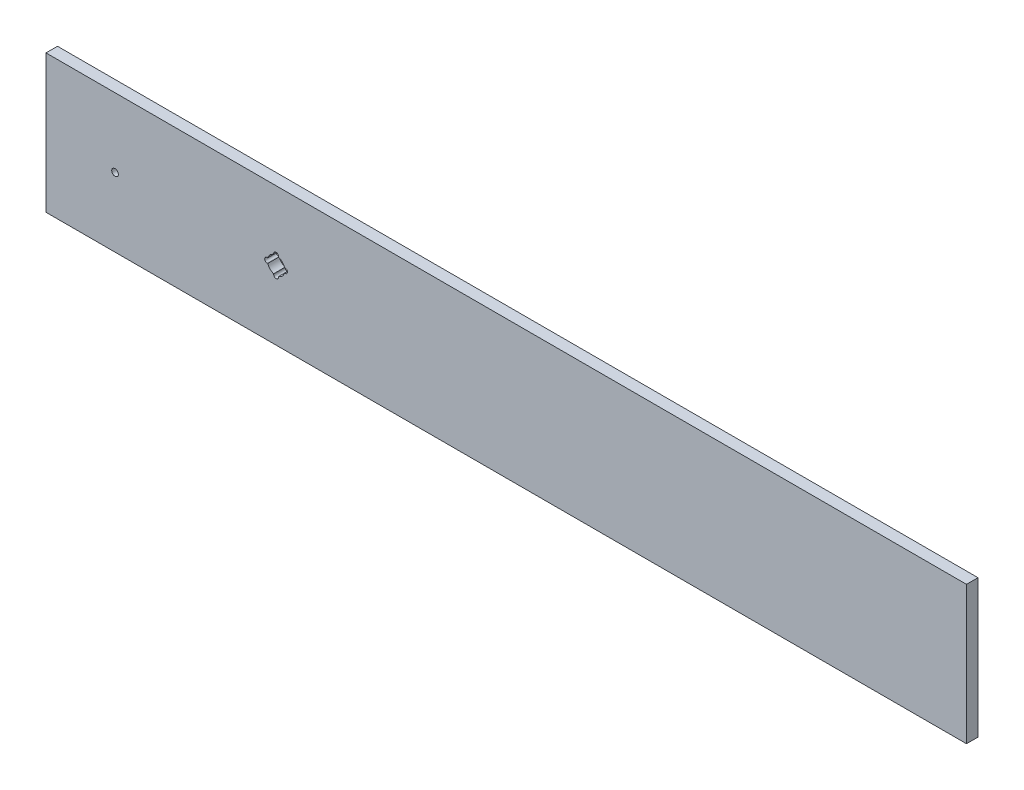
ISO-10303-21;
HEADER;
FILE_DESCRIPTION(('STEP AP214'),'2;1');
FILE_NAME('part.step','',(''),(''),'','','');
FILE_SCHEMA(('AUTOMOTIVE_DESIGN { 1 0 10303 214 1 1 1 1 }'));
ENDSEC;
DATA;
#1=APPLICATION_CONTEXT('core data for automotive mechanical design processes');
#2=APPLICATION_PROTOCOL_DEFINITION('international standard','automotive_design',2000,#1);
#3=PRODUCT_CONTEXT('',#1,'mechanical');
#4=PRODUCT('Part','Part','',(#3));
#5=PRODUCT_RELATED_PRODUCT_CATEGORY('part','',(#4));
#6=PRODUCT_DEFINITION_FORMATION('','',#4);
#7=PRODUCT_DEFINITION_CONTEXT('part definition',#1,'design');
#8=PRODUCT_DEFINITION('design','',#6,#7);
#9=PRODUCT_DEFINITION_SHAPE('','',#8);
#10=(LENGTH_UNIT() NAMED_UNIT(*) SI_UNIT(.MILLI.,.METRE.));
#11=(NAMED_UNIT(*) PLANE_ANGLE_UNIT() SI_UNIT($,.RADIAN.));
#12=(NAMED_UNIT(*) SI_UNIT($,.STERADIAN.) SOLID_ANGLE_UNIT());
#13=UNCERTAINTY_MEASURE_WITH_UNIT(LENGTH_MEASURE(1.E-05),#10,'distance_accuracy_value','');
#14=(GEOMETRIC_REPRESENTATION_CONTEXT(3) GLOBAL_UNCERTAINTY_ASSIGNED_CONTEXT((#13)) GLOBAL_UNIT_ASSIGNED_CONTEXT((#10,
#11,#12)) REPRESENTATION_CONTEXT('',''));
#15=CARTESIAN_POINT('',(0.,0.,0.));
#16=DIRECTION('',(0.,0.,1.));
#17=DIRECTION('',(1.,0.,0.));
#18=AXIS2_PLACEMENT_3D('',#15,#16,#17);
#19=CARTESIAN_POINT('',(0.,76.2,6.35));
#20=DIRECTION('',(0.,0.,-1.));
#21=DIRECTION('',(-1.,0.,0.));
#22=AXIS2_PLACEMENT_3D('',#19,#20,#21);
#23=PLANE('',#22);
#24=CARTESIAN_POINT('',(38.1,38.1,6.35));
#25=DIRECTION('',(0.,0.,1.));
#26=DIRECTION('',(1.,0.,0.));
#27=AXIS2_PLACEMENT_3D('',#24,#25,#26);
#28=CIRCLE('',#27,1.84149999999999);
#29=CARTESIAN_POINT('',(39.9415,38.1,6.35));
#30=VERTEX_POINT('',#29);
#31=EDGE_CURVE('E506',#30,#30,#28,.T.);
#32=ORIENTED_EDGE('',*,*,#31,.F.);
#33=EDGE_LOOP('',(#32));
#34=FACE_BOUND('',#33,.T.);
#35=DIRECTION('',(0.,-1.,0.));
#36=VECTOR('',#35,1.);
#37=CARTESIAN_POINT('',(0.,0.,6.35));
#38=LINE('',#37,#36);
#39=CARTESIAN_POINT('',(0.,76.2,6.35));
#40=VERTEX_POINT('',#39);
#41=CARTESIAN_POINT('',(0.,0.,6.35));
#42=VERTEX_POINT('',#41);
#43=EDGE_CURVE('E293',#40,#42,#38,.T.);
#44=ORIENTED_EDGE('',*,*,#43,.T.);
#45=DIRECTION('',(1.,0.,0.));
#46=VECTOR('',#45,1.);
#47=CARTESIAN_POINT('',(0.,0.,6.35));
#48=LINE('',#47,#46);
#49=CARTESIAN_POINT('',(508.,0.,6.35));
#50=VERTEX_POINT('',#49);
#51=EDGE_CURVE('E296',#42,#50,#48,.T.);
#52=ORIENTED_EDGE('',*,*,#51,.T.);
#53=DIRECTION('',(0.,1.,0.));
#54=VECTOR('',#53,1.);
#55=CARTESIAN_POINT('',(508.,0.,6.35));
#56=LINE('',#55,#54);
#57=CARTESIAN_POINT('',(508.,76.2,6.35));
#58=VERTEX_POINT('',#57);
#59=EDGE_CURVE('E299',#50,#58,#56,.T.);
#60=ORIENTED_EDGE('',*,*,#59,.T.);
#61=DIRECTION('',(-1.,0.,0.));
#62=VECTOR('',#61,1.);
#63=CARTESIAN_POINT('',(0.,76.2,6.35));
#64=LINE('',#63,#62);
#65=EDGE_CURVE('E301',#58,#40,#64,.T.);
#66=ORIENTED_EDGE('',*,*,#65,.T.);
#67=EDGE_LOOP('',(#44,#52,#60,#66));
#68=FACE_BOUND('',#67,.T.);
#69=DIRECTION('',(1.,0.,0.));
#70=VECTOR('',#69,1.);
#71=CARTESIAN_POINT('',(254.,39.4462,6.35));
#72=LINE('',#71,#70);
#73=CARTESIAN_POINT('',(131.60798284719,39.4462,6.35));
#74=VERTEX_POINT('',#73);
#75=CARTESIAN_POINT('',(131.953,39.4462,6.35));
#76=VERTEX_POINT('',#75);
#77=EDGE_CURVE('E491',#74,#76,#72,.T.);
#78=ORIENTED_EDGE('',*,*,#77,.T.);
#79=CARTESIAN_POINT('',(131.953,38.1,6.35));
#80=DIRECTION('',(0.,0.,1.));
#81=DIRECTION('',(1.,0.,0.));
#82=AXIS2_PLACEMENT_3D('',#79,#80,#81);
#83=CIRCLE('',#82,1.3462);
#84=CARTESIAN_POINT('',(131.953,36.7538,6.35));
#85=VERTEX_POINT('',#84);
#86=EDGE_CURVE('E493',#85,#76,#83,.T.);
#87=ORIENTED_EDGE('',*,*,#86,.F.);
#88=DIRECTION('',(1.,0.,0.));
#89=VECTOR('',#88,1.);
#90=CARTESIAN_POINT('',(254.,36.7538,6.35));
#91=LINE('',#90,#89);
#92=CARTESIAN_POINT('',(131.60798284719,36.7538,6.35));
#93=VERTEX_POINT('',#92);
#94=EDGE_CURVE('E496',#93,#85,#91,.T.);
#95=ORIENTED_EDGE('',*,*,#94,.F.);
#96=CARTESIAN_POINT('',(127.,38.1,6.35));
#97=DIRECTION('',(0.,0.,1.));
#98=DIRECTION('',(1.,0.,0.));
#99=AXIS2_PLACEMENT_3D('',#96,#97,#98);
#100=CIRCLE('',#99,4.80059999999999);
#101=CARTESIAN_POINT('',(128.3462,33.4920171528097,6.35));
#102=VERTEX_POINT('',#101);
#103=EDGE_CURVE('E431',#93,#102,#100,.F.);
#104=ORIENTED_EDGE('',*,*,#103,.T.);
#105=DIRECTION('',(0.,-1.,0.));
#106=VECTOR('',#105,1.);
#107=CARTESIAN_POINT('',(128.3462,43.053,6.35));
#108=LINE('',#107,#106);
#109=CARTESIAN_POINT('',(128.3462,33.147,6.35));
#110=VERTEX_POINT('',#109);
#111=EDGE_CURVE('E236',#102,#110,#108,.T.);
#112=ORIENTED_EDGE('',*,*,#111,.T.);
#113=CARTESIAN_POINT('',(127.,33.147,6.35));
#114=DIRECTION('',(0.,0.,1.));
#115=DIRECTION('',(1.,0.,0.));
#116=AXIS2_PLACEMENT_3D('',#113,#114,#115);
#117=CIRCLE('',#116,1.34619999999998);
#118=CARTESIAN_POINT('',(125.6538,33.147,6.35));
#119=VERTEX_POINT('',#118);
#120=EDGE_CURVE('E278',#119,#110,#117,.T.);
#121=ORIENTED_EDGE('',*,*,#120,.F.);
#122=DIRECTION('',(0.,-1.,0.));
#123=VECTOR('',#122,1.);
#124=CARTESIAN_POINT('',(125.6538,43.053,6.35));
#125=LINE('',#124,#123);
#126=CARTESIAN_POINT('',(125.6538,33.4920171528097,6.35));
#127=VERTEX_POINT('',#126);
#128=EDGE_CURVE('E281',#127,#119,#125,.T.);
#129=ORIENTED_EDGE('',*,*,#128,.F.);
#130=CARTESIAN_POINT('',(127.,38.1,6.35));
#131=DIRECTION('',(0.,0.,1.));
#132=DIRECTION('',(1.,0.,0.));
#133=AXIS2_PLACEMENT_3D('',#130,#131,#132);
#134=CIRCLE('',#133,4.8006);
#135=CARTESIAN_POINT('',(122.39201715281,36.7538,6.35));
#136=VERTEX_POINT('',#135);
#137=EDGE_CURVE('E439',#136,#127,#134,.T.);
#138=ORIENTED_EDGE('',*,*,#137,.F.);
#139=DIRECTION('',(1.,0.,0.));
#140=VECTOR('',#139,1.);
#141=CARTESIAN_POINT('',(254.,36.7538,6.35));
#142=LINE('',#141,#140);
#143=CARTESIAN_POINT('',(122.047,36.7538,6.35));
#144=VERTEX_POINT('',#143);
#145=EDGE_CURVE('E461',#144,#136,#142,.T.);
#146=ORIENTED_EDGE('',*,*,#145,.F.);
#147=CARTESIAN_POINT('',(122.047,38.1,6.35));
#148=DIRECTION('',(0.,0.,1.));
#149=DIRECTION('',(1.,0.,0.));
#150=AXIS2_PLACEMENT_3D('',#147,#148,#149);
#151=CIRCLE('',#150,1.3462);
#152=CARTESIAN_POINT('',(122.047,39.4462,6.35));
#153=VERTEX_POINT('',#152);
#154=EDGE_CURVE('E453',#153,#144,#151,.T.);
#155=ORIENTED_EDGE('',*,*,#154,.F.);
#156=DIRECTION('',(1.,0.,0.));
#157=VECTOR('',#156,1.);
#158=CARTESIAN_POINT('',(254.,39.4462,6.35));
#159=LINE('',#158,#157);
#160=CARTESIAN_POINT('',(122.39201715281,39.4462,6.35));
#161=VERTEX_POINT('',#160);
#162=EDGE_CURVE('E451',#153,#161,#159,.T.);
#163=ORIENTED_EDGE('',*,*,#162,.T.);
#164=CARTESIAN_POINT('',(127.,38.1,6.35));
#165=DIRECTION('',(0.,0.,1.));
#166=DIRECTION('',(1.,0.,0.));
#167=AXIS2_PLACEMENT_3D('',#164,#165,#166);
#168=CIRCLE('',#167,4.8006);
#169=CARTESIAN_POINT('',(125.6538,42.7079828471903,6.35));
#170=VERTEX_POINT('',#169);
#171=EDGE_CURVE('E292',#161,#170,#168,.F.);
#172=ORIENTED_EDGE('',*,*,#171,.T.);
#173=CARTESIAN_POINT('',(125.6538,43.053,6.35));
#174=VERTEX_POINT('',#173);
#175=EDGE_CURVE('E262',#174,#170,#125,.T.);
#176=ORIENTED_EDGE('',*,*,#175,.F.);
#177=CARTESIAN_POINT('',(127.,43.053,6.35));
#178=DIRECTION('',(0.,0.,1.));
#179=DIRECTION('',(1.,0.,0.));
#180=AXIS2_PLACEMENT_3D('',#177,#178,#179);
#181=CIRCLE('',#180,1.34619999999998);
#182=CARTESIAN_POINT('',(128.3462,43.053,6.35));
#183=VERTEX_POINT('',#182);
#184=EDGE_CURVE('E258',#183,#174,#181,.T.);
#185=ORIENTED_EDGE('',*,*,#184,.F.);
#186=CARTESIAN_POINT('',(128.3462,42.7079828471903,6.35));
#187=VERTEX_POINT('',#186);
#188=EDGE_CURVE('E275',#183,#187,#108,.T.);
#189=ORIENTED_EDGE('',*,*,#188,.T.);
#190=CARTESIAN_POINT('',(127.,38.1,6.35));
#191=DIRECTION('',(0.,0.,1.));
#192=DIRECTION('',(1.,0.,0.));
#193=AXIS2_PLACEMENT_3D('',#190,#191,#192);
#194=CIRCLE('',#193,4.80060000000002);
#195=EDGE_CURVE('E108',#74,#187,#194,.T.);
#196=ORIENTED_EDGE('',*,*,#195,.F.);
#197=EDGE_LOOP('',(#78,#87,#95,#104,#112,#121,#129,#138,#146,#155,#163,#172,#176,#185,#189,#196));
#198=FACE_BOUND('',#197,.T.);
#199=ADVANCED_FACE('F93',(#34,#68,#198),#23,.F.);
#200=CARTESIAN_POINT('',(0.,76.2,0.));
#201=DIRECTION('',(0.,0.,-1.));
#202=DIRECTION('',(-1.,0.,0.));
#203=AXIS2_PLACEMENT_3D('',#200,#201,#202);
#204=PLANE('',#203);
#205=CARTESIAN_POINT('',(38.1,38.1,0.));
#206=DIRECTION('',(0.,0.,1.));
#207=DIRECTION('',(1.,0.,0.));
#208=AXIS2_PLACEMENT_3D('',#205,#206,#207);
#209=CIRCLE('',#208,1.84149999999999);
#210=CARTESIAN_POINT('',(39.9415,38.1,0.));
#211=VERTEX_POINT('',#210);
#212=EDGE_CURVE('E509',#211,#211,#209,.T.);
#213=ORIENTED_EDGE('',*,*,#212,.T.);
#214=EDGE_LOOP('',(#213));
#215=FACE_BOUND('',#214,.T.);
#216=DIRECTION('',(0.,-1.,0.));
#217=VECTOR('',#216,1.);
#218=CARTESIAN_POINT('',(0.,0.,0.));
#219=LINE('',#218,#217);
#220=CARTESIAN_POINT('',(0.,76.2,0.));
#221=VERTEX_POINT('',#220);
#222=CARTESIAN_POINT('',(0.,0.,0.));
#223=VERTEX_POINT('',#222);
#224=EDGE_CURVE('E304',#221,#223,#219,.T.);
#225=ORIENTED_EDGE('',*,*,#224,.F.);
#226=DIRECTION('',(-1.,0.,0.));
#227=VECTOR('',#226,1.);
#228=CARTESIAN_POINT('',(0.,76.2,0.));
#229=LINE('',#228,#227);
#230=CARTESIAN_POINT('',(508.,76.2,0.));
#231=VERTEX_POINT('',#230);
#232=EDGE_CURVE('E297',#231,#221,#229,.T.);
#233=ORIENTED_EDGE('',*,*,#232,.F.);
#234=DIRECTION('',(0.,1.,0.));
#235=VECTOR('',#234,1.);
#236=CARTESIAN_POINT('',(508.,0.,0.));
#237=LINE('',#236,#235);
#238=CARTESIAN_POINT('',(508.,0.,0.));
#239=VERTEX_POINT('',#238);
#240=EDGE_CURVE('E310',#239,#231,#237,.T.);
#241=ORIENTED_EDGE('',*,*,#240,.F.);
#242=DIRECTION('',(1.,0.,0.));
#243=VECTOR('',#242,1.);
#244=CARTESIAN_POINT('',(0.,0.,0.));
#245=LINE('',#244,#243);
#246=EDGE_CURVE('E307',#223,#239,#245,.T.);
#247=ORIENTED_EDGE('',*,*,#246,.F.);
#248=EDGE_LOOP('',(#225,#233,#241,#247));
#249=FACE_BOUND('',#248,.T.);
#250=CARTESIAN_POINT('',(131.953,38.1,0.));
#251=DIRECTION('',(0.,0.,1.));
#252=DIRECTION('',(1.,0.,0.));
#253=AXIS2_PLACEMENT_3D('',#250,#251,#252);
#254=CIRCLE('',#253,1.3462);
#255=CARTESIAN_POINT('',(131.953,36.7538,0.));
#256=VERTEX_POINT('',#255);
#257=CARTESIAN_POINT('',(131.953,39.4462,0.));
#258=VERTEX_POINT('',#257);
#259=EDGE_CURVE('E503',#256,#258,#254,.T.);
#260=ORIENTED_EDGE('',*,*,#259,.T.);
#261=DIRECTION('',(1.,0.,0.));
#262=VECTOR('',#261,1.);
#263=CARTESIAN_POINT('',(254.,39.4462,0.));
#264=LINE('',#263,#262);
#265=CARTESIAN_POINT('',(131.60798284719,39.4462,0.));
#266=VERTEX_POINT('',#265);
#267=EDGE_CURVE('E501',#266,#258,#264,.T.);
#268=ORIENTED_EDGE('',*,*,#267,.F.);
#269=CARTESIAN_POINT('',(127.,38.1,0.));
#270=DIRECTION('',(0.,0.,1.));
#271=DIRECTION('',(1.,0.,0.));
#272=AXIS2_PLACEMENT_3D('',#269,#270,#271);
#273=CIRCLE('',#272,4.80060000000002);
#274=CARTESIAN_POINT('',(128.3462,42.7079828471903,0.));
#275=VERTEX_POINT('',#274);
#276=EDGE_CURVE('E241',#266,#275,#273,.T.);
#277=ORIENTED_EDGE('',*,*,#276,.T.);
#278=DIRECTION('',(0.,-1.,0.));
#279=VECTOR('',#278,1.);
#280=CARTESIAN_POINT('',(128.3462,43.053,0.));
#281=LINE('',#280,#279);
#282=CARTESIAN_POINT('',(128.3462,43.053,0.));
#283=VERTEX_POINT('',#282);
#284=EDGE_CURVE('E257',#283,#275,#281,.T.);
#285=ORIENTED_EDGE('',*,*,#284,.F.);
#286=CARTESIAN_POINT('',(127.,43.053,0.));
#287=DIRECTION('',(0.,0.,1.));
#288=DIRECTION('',(1.,0.,0.));
#289=AXIS2_PLACEMENT_3D('',#286,#287,#288);
#290=CIRCLE('',#289,1.34619999999998);
#291=CARTESIAN_POINT('',(125.6538,43.053,0.));
#292=VERTEX_POINT('',#291);
#293=EDGE_CURVE('E116',#283,#292,#290,.T.);
#294=ORIENTED_EDGE('',*,*,#293,.T.);
#295=DIRECTION('',(0.,-1.,0.));
#296=VECTOR('',#295,1.);
#297=CARTESIAN_POINT('',(125.6538,43.053,0.));
#298=LINE('',#297,#296);
#299=CARTESIAN_POINT('',(125.6538,42.7079828471903,0.));
#300=VERTEX_POINT('',#299);
#301=EDGE_CURVE('E270',#292,#300,#298,.T.);
#302=ORIENTED_EDGE('',*,*,#301,.T.);
#303=CARTESIAN_POINT('',(127.,38.1,0.));
#304=DIRECTION('',(0.,0.,1.));
#305=DIRECTION('',(1.,0.,0.));
#306=AXIS2_PLACEMENT_3D('',#303,#304,#305);
#307=CIRCLE('',#306,4.8006);
#308=CARTESIAN_POINT('',(122.39201715281,39.4462,0.));
#309=VERTEX_POINT('',#308);
#310=EDGE_CURVE('E436',#309,#300,#307,.F.);
#311=ORIENTED_EDGE('',*,*,#310,.F.);
#312=DIRECTION('',(1.,0.,0.));
#313=VECTOR('',#312,1.);
#314=CARTESIAN_POINT('',(254.,39.4462,0.));
#315=LINE('',#314,#313);
#316=CARTESIAN_POINT('',(122.047,39.4462,0.));
#317=VERTEX_POINT('',#316);
#318=EDGE_CURVE('E438',#317,#309,#315,.T.);
#319=ORIENTED_EDGE('',*,*,#318,.F.);
#320=CARTESIAN_POINT('',(122.047,38.1,0.));
#321=DIRECTION('',(0.,0.,1.));
#322=DIRECTION('',(1.,0.,0.));
#323=AXIS2_PLACEMENT_3D('',#320,#321,#322);
#324=CIRCLE('',#323,1.3462);
#325=CARTESIAN_POINT('',(122.047,36.7538,0.));
#326=VERTEX_POINT('',#325);
#327=EDGE_CURVE('E476',#317,#326,#324,.T.);
#328=ORIENTED_EDGE('',*,*,#327,.T.);
#329=DIRECTION('',(1.,0.,0.));
#330=VECTOR('',#329,1.);
#331=CARTESIAN_POINT('',(254.,36.7538,0.));
#332=LINE('',#331,#330);
#333=CARTESIAN_POINT('',(122.39201715281,36.7538,0.));
#334=VERTEX_POINT('',#333);
#335=EDGE_CURVE('E473',#326,#334,#332,.T.);
#336=ORIENTED_EDGE('',*,*,#335,.T.);
#337=CARTESIAN_POINT('',(127.,38.1,0.));
#338=DIRECTION('',(0.,0.,1.));
#339=DIRECTION('',(1.,0.,0.));
#340=AXIS2_PLACEMENT_3D('',#337,#338,#339);
#341=CIRCLE('',#340,4.8006);
#342=CARTESIAN_POINT('',(125.6538,33.4920171528097,0.));
#343=VERTEX_POINT('',#342);
#344=EDGE_CURVE('E456',#334,#343,#341,.T.);
#345=ORIENTED_EDGE('',*,*,#344,.T.);
#346=CARTESIAN_POINT('',(125.6538,33.147,0.));
#347=VERTEX_POINT('',#346);
#348=EDGE_CURVE('E269',#343,#347,#298,.T.);
#349=ORIENTED_EDGE('',*,*,#348,.T.);
#350=CARTESIAN_POINT('',(127.,33.147,0.));
#351=DIRECTION('',(0.,0.,1.));
#352=DIRECTION('',(1.,0.,0.));
#353=AXIS2_PLACEMENT_3D('',#350,#351,#352);
#354=CIRCLE('',#353,1.34619999999998);
#355=CARTESIAN_POINT('',(128.3462,33.147,0.));
#356=VERTEX_POINT('',#355);
#357=EDGE_CURVE('E256',#347,#356,#354,.T.);
#358=ORIENTED_EDGE('',*,*,#357,.T.);
#359=CARTESIAN_POINT('',(128.3462,33.4920171528097,0.));
#360=VERTEX_POINT('',#359);
#361=EDGE_CURVE('E233',#360,#356,#281,.T.);
#362=ORIENTED_EDGE('',*,*,#361,.F.);
#363=CARTESIAN_POINT('',(127.,38.1,0.));
#364=DIRECTION('',(0.,0.,1.));
#365=DIRECTION('',(1.,0.,0.));
#366=AXIS2_PLACEMENT_3D('',#363,#364,#365);
#367=CIRCLE('',#366,4.80059999999999);
#368=CARTESIAN_POINT('',(131.60798284719,36.7538,0.));
#369=VERTEX_POINT('',#368);
#370=EDGE_CURVE('E244',#369,#360,#367,.F.);
#371=ORIENTED_EDGE('',*,*,#370,.F.);
#372=DIRECTION('',(1.,0.,0.));
#373=VECTOR('',#372,1.);
#374=CARTESIAN_POINT('',(254.,36.7538,0.));
#375=LINE('',#374,#373);
#376=EDGE_CURVE('E249',#369,#256,#375,.T.);
#377=ORIENTED_EDGE('',*,*,#376,.T.);
#378=EDGE_LOOP('',(#260,#268,#277,#285,#294,#302,#311,#319,#328,#336,#345,#349,#358,#362,#371,#377));
#379=FACE_BOUND('',#378,.T.);
#380=ADVANCED_FACE('F253',(#215,#249,#379),#204,.T.);
#381=CARTESIAN_POINT('',(0.,0.,6.35));
#382=DIRECTION('',(1.,0.,0.));
#383=DIRECTION('',(0.,0.,-1.));
#384=AXIS2_PLACEMENT_3D('',#381,#382,#383);
#385=PLANE('',#384);
#386=ORIENTED_EDGE('',*,*,#224,.T.);
#387=DIRECTION('',(0.,0.,-1.));
#388=VECTOR('',#387,1.);
#389=CARTESIAN_POINT('',(0.,0.,6.35));
#390=LINE('',#389,#388);
#391=EDGE_CURVE('E12',#42,#223,#390,.T.);
#392=ORIENTED_EDGE('',*,*,#391,.F.);
#393=ORIENTED_EDGE('',*,*,#43,.F.);
#394=DIRECTION('',(0.,0.,-1.));
#395=VECTOR('',#394,1.);
#396=CARTESIAN_POINT('',(0.,76.2,6.35));
#397=LINE('',#396,#395);
#398=EDGE_CURVE('E303',#40,#221,#397,.T.);
#399=ORIENTED_EDGE('',*,*,#398,.T.);
#400=EDGE_LOOP('',(#386,#392,#393,#399));
#401=FACE_BOUND('',#400,.T.);
#402=ADVANCED_FACE('F95',(#401),#385,.F.);
#403=CARTESIAN_POINT('',(0.,0.,6.35));
#404=DIRECTION('',(0.,1.,0.));
#405=DIRECTION('',(0.,0.,1.));
#406=AXIS2_PLACEMENT_3D('',#403,#404,#405);
#407=PLANE('',#406);
#408=ORIENTED_EDGE('',*,*,#246,.T.);
#409=DIRECTION('',(0.,0.,-1.));
#410=VECTOR('',#409,1.);
#411=CARTESIAN_POINT('',(508.,0.,6.35));
#412=LINE('',#411,#410);
#413=EDGE_CURVE('E101',#50,#239,#412,.T.);
#414=ORIENTED_EDGE('',*,*,#413,.F.);
#415=ORIENTED_EDGE('',*,*,#51,.F.);
#416=ORIENTED_EDGE('',*,*,#391,.T.);
#417=EDGE_LOOP('',(#408,#414,#415,#416));
#418=FACE_BOUND('',#417,.T.);
#419=ADVANCED_FACE('F337',(#418),#407,.F.);
#420=CARTESIAN_POINT('',(508.,0.,6.35));
#421=DIRECTION('',(-1.,0.,0.));
#422=DIRECTION('',(0.,0.,1.));
#423=AXIS2_PLACEMENT_3D('',#420,#421,#422);
#424=PLANE('',#423);
#425=ORIENTED_EDGE('',*,*,#240,.T.);
#426=DIRECTION('',(0.,0.,-1.));
#427=VECTOR('',#426,1.);
#428=CARTESIAN_POINT('',(508.,76.2,6.35));
#429=LINE('',#428,#427);
#430=EDGE_CURVE('E315',#58,#231,#429,.T.);
#431=ORIENTED_EDGE('',*,*,#430,.F.);
#432=ORIENTED_EDGE('',*,*,#59,.F.);
#433=ORIENTED_EDGE('',*,*,#413,.T.);
#434=EDGE_LOOP('',(#425,#431,#432,#433));
#435=FACE_BOUND('',#434,.T.);
#436=ADVANCED_FACE('F322',(#435),#424,.F.);
#437=CARTESIAN_POINT('',(0.,76.2,6.35));
#438=DIRECTION('',(0.,-1.,0.));
#439=DIRECTION('',(0.,0.,-1.));
#440=AXIS2_PLACEMENT_3D('',#437,#438,#439);
#441=PLANE('',#440);
#442=ORIENTED_EDGE('',*,*,#232,.T.);
#443=ORIENTED_EDGE('',*,*,#398,.F.);
#444=ORIENTED_EDGE('',*,*,#65,.F.);
#445=ORIENTED_EDGE('',*,*,#430,.T.);
#446=EDGE_LOOP('',(#442,#443,#444,#445));
#447=FACE_BOUND('',#446,.T.);
#448=ADVANCED_FACE('F330',(#447),#441,.F.);
#449=CARTESIAN_POINT('',(127.,38.1,0.));
#450=DIRECTION('',(0.,0.,1.));
#451=DIRECTION('',(1.,0.,0.));
#452=AXIS2_PLACEMENT_3D('',#449,#450,#451);
#453=CYLINDRICAL_SURFACE('',#452,4.80060000000002);
#454=ORIENTED_EDGE('',*,*,#195,.T.);
#455=DIRECTION('',(0.,0.,1.));
#456=VECTOR('',#455,1.);
#457=CARTESIAN_POINT('',(128.3462,42.7079828471903,0.));
#458=LINE('',#457,#456);
#459=EDGE_CURVE('E308',#275,#187,#458,.T.);
#460=ORIENTED_EDGE('',*,*,#459,.F.);
#461=ORIENTED_EDGE('',*,*,#276,.F.);
#462=DIRECTION('',(0.,0.,1.));
#463=VECTOR('',#462,1.);
#464=CARTESIAN_POINT('',(131.60798284719,39.4462,0.));
#465=LINE('',#464,#463);
#466=EDGE_CURVE('E487',#266,#74,#465,.T.);
#467=ORIENTED_EDGE('',*,*,#466,.T.);
#468=EDGE_LOOP('',(#454,#460,#461,#467));
#469=FACE_BOUND('',#468,.T.);
#470=ADVANCED_FACE('F358',(#469),#453,.F.);
#471=CARTESIAN_POINT('',(254.,39.4462,0.));
#472=DIRECTION('',(0.,-1.,0.));
#473=DIRECTION('',(0.,0.,-1.));
#474=AXIS2_PLACEMENT_3D('',#471,#472,#473);
#475=PLANE('',#474);
#476=ORIENTED_EDGE('',*,*,#77,.F.);
#477=ORIENTED_EDGE('',*,*,#466,.F.);
#478=ORIENTED_EDGE('',*,*,#267,.T.);
#479=DIRECTION('',(0.,0.,1.));
#480=VECTOR('',#479,1.);
#481=CARTESIAN_POINT('',(131.953,39.4462,0.));
#482=LINE('',#481,#480);
#483=EDGE_CURVE('E485',#258,#76,#482,.T.);
#484=ORIENTED_EDGE('',*,*,#483,.T.);
#485=EDGE_LOOP('',(#476,#477,#478,#484));
#486=FACE_BOUND('',#485,.T.);
#487=ADVANCED_FACE('F362',(#486),#475,.T.);
#488=CARTESIAN_POINT('',(131.953,38.1,0.));
#489=DIRECTION('',(0.,0.,1.));
#490=DIRECTION('',(1.,0.,0.));
#491=AXIS2_PLACEMENT_3D('',#488,#489,#490);
#492=CYLINDRICAL_SURFACE('',#491,1.3462);
#493=ORIENTED_EDGE('',*,*,#86,.T.);
#494=ORIENTED_EDGE('',*,*,#483,.F.);
#495=ORIENTED_EDGE('',*,*,#259,.F.);
#496=DIRECTION('',(0.,0.,1.));
#497=VECTOR('',#496,1.);
#498=CARTESIAN_POINT('',(131.953,36.7538,0.));
#499=LINE('',#498,#497);
#500=EDGE_CURVE('E483',#256,#85,#499,.T.);
#501=ORIENTED_EDGE('',*,*,#500,.T.);
#502=EDGE_LOOP('',(#493,#494,#495,#501));
#503=FACE_BOUND('',#502,.T.);
#504=ADVANCED_FACE('F367',(#503),#492,.F.);
#505=CARTESIAN_POINT('',(254.,36.7538,0.));
#506=DIRECTION('',(0.,-1.,0.));
#507=DIRECTION('',(0.,0.,-1.));
#508=AXIS2_PLACEMENT_3D('',#505,#506,#507);
#509=PLANE('',#508);
#510=ORIENTED_EDGE('',*,*,#94,.T.);
#511=ORIENTED_EDGE('',*,*,#500,.F.);
#512=ORIENTED_EDGE('',*,*,#376,.F.);
#513=DIRECTION('',(0.,0.,1.));
#514=VECTOR('',#513,1.);
#515=CARTESIAN_POINT('',(131.60798284719,36.7538,0.));
#516=LINE('',#515,#514);
#517=EDGE_CURVE('E240',#369,#93,#516,.T.);
#518=ORIENTED_EDGE('',*,*,#517,.T.);
#519=EDGE_LOOP('',(#510,#511,#512,#518));
#520=FACE_BOUND('',#519,.T.);
#521=ADVANCED_FACE('F375',(#520),#509,.F.);
#522=CARTESIAN_POINT('',(127.,38.1,0.));
#523=DIRECTION('',(0.,0.,1.));
#524=DIRECTION('',(1.,0.,0.));
#525=AXIS2_PLACEMENT_3D('',#522,#523,#524);
#526=CYLINDRICAL_SURFACE('',#525,4.80059999999999);
#527=ORIENTED_EDGE('',*,*,#103,.F.);
#528=ORIENTED_EDGE('',*,*,#517,.F.);
#529=ORIENTED_EDGE('',*,*,#370,.T.);
#530=DIRECTION('',(0.,0.,1.));
#531=VECTOR('',#530,1.);
#532=CARTESIAN_POINT('',(128.3462,33.4920171528097,0.));
#533=LINE('',#532,#531);
#534=EDGE_CURVE('E229',#360,#102,#533,.T.);
#535=ORIENTED_EDGE('',*,*,#534,.T.);
#536=EDGE_LOOP('',(#527,#528,#529,#535));
#537=FACE_BOUND('',#536,.T.);
#538=ADVANCED_FACE('F245',(#537),#526,.F.);
#539=CARTESIAN_POINT('',(127.,38.1,0.));
#540=DIRECTION('',(0.,0.,1.));
#541=DIRECTION('',(1.,0.,0.));
#542=AXIS2_PLACEMENT_3D('',#539,#540,#541);
#543=CYLINDRICAL_SURFACE('',#542,4.8006);
#544=ORIENTED_EDGE('',*,*,#137,.T.);
#545=DIRECTION('',(0.,0.,1.));
#546=VECTOR('',#545,1.);
#547=CARTESIAN_POINT('',(125.6538,33.4920171528097,0.));
#548=LINE('',#547,#546);
#549=EDGE_CURVE('E432',#343,#127,#548,.T.);
#550=ORIENTED_EDGE('',*,*,#549,.F.);
#551=ORIENTED_EDGE('',*,*,#344,.F.);
#552=DIRECTION('',(0.,0.,1.));
#553=VECTOR('',#552,1.);
#554=CARTESIAN_POINT('',(122.39201715281,36.7538,0.));
#555=LINE('',#554,#553);
#556=EDGE_CURVE('E467',#334,#136,#555,.T.);
#557=ORIENTED_EDGE('',*,*,#556,.T.);
#558=EDGE_LOOP('',(#544,#550,#551,#557));
#559=FACE_BOUND('',#558,.T.);
#560=ADVANCED_FACE('F382',(#559),#543,.F.);
#561=CARTESIAN_POINT('',(254.,36.7538,0.));
#562=DIRECTION('',(0.,-1.,0.));
#563=DIRECTION('',(0.,0.,-1.));
#564=AXIS2_PLACEMENT_3D('',#561,#562,#563);
#565=PLANE('',#564);
#566=ORIENTED_EDGE('',*,*,#145,.T.);
#567=ORIENTED_EDGE('',*,*,#556,.F.);
#568=ORIENTED_EDGE('',*,*,#335,.F.);
#569=DIRECTION('',(0.,0.,1.));
#570=VECTOR('',#569,1.);
#571=CARTESIAN_POINT('',(122.047,36.7538,0.));
#572=LINE('',#571,#570);
#573=EDGE_CURVE('E469',#326,#144,#572,.T.);
#574=ORIENTED_EDGE('',*,*,#573,.T.);
#575=EDGE_LOOP('',(#566,#567,#568,#574));
#576=FACE_BOUND('',#575,.T.);
#577=ADVANCED_FACE('F385',(#576),#565,.F.);
#578=CARTESIAN_POINT('',(122.047,38.1,0.));
#579=DIRECTION('',(0.,0.,1.));
#580=DIRECTION('',(1.,0.,0.));
#581=AXIS2_PLACEMENT_3D('',#578,#579,#580);
#582=CYLINDRICAL_SURFACE('',#581,1.3462);
#583=ORIENTED_EDGE('',*,*,#154,.T.);
#584=ORIENTED_EDGE('',*,*,#573,.F.);
#585=ORIENTED_EDGE('',*,*,#327,.F.);
#586=DIRECTION('',(0.,0.,1.));
#587=VECTOR('',#586,1.);
#588=CARTESIAN_POINT('',(122.047,39.4462,0.));
#589=LINE('',#588,#587);
#590=EDGE_CURVE('E470',#317,#153,#589,.T.);
#591=ORIENTED_EDGE('',*,*,#590,.T.);
#592=EDGE_LOOP('',(#583,#584,#585,#591));
#593=FACE_BOUND('',#592,.T.);
#594=ADVANCED_FACE('F390',(#593),#582,.F.);
#595=CARTESIAN_POINT('',(254.,39.4462,0.));
#596=DIRECTION('',(0.,-1.,0.));
#597=DIRECTION('',(0.,0.,-1.));
#598=AXIS2_PLACEMENT_3D('',#595,#596,#597);
#599=PLANE('',#598);
#600=ORIENTED_EDGE('',*,*,#162,.F.);
#601=ORIENTED_EDGE('',*,*,#590,.F.);
#602=ORIENTED_EDGE('',*,*,#318,.T.);
#603=DIRECTION('',(0.,0.,1.));
#604=VECTOR('',#603,1.);
#605=CARTESIAN_POINT('',(122.39201715281,39.4462,0.));
#606=LINE('',#605,#604);
#607=EDGE_CURVE('E266',#309,#161,#606,.T.);
#608=ORIENTED_EDGE('',*,*,#607,.T.);
#609=EDGE_LOOP('',(#600,#601,#602,#608));
#610=FACE_BOUND('',#609,.T.);
#611=ADVANCED_FACE('F394',(#610),#599,.T.);
#612=CARTESIAN_POINT('',(127.,38.1,0.));
#613=DIRECTION('',(0.,0.,1.));
#614=DIRECTION('',(1.,0.,0.));
#615=AXIS2_PLACEMENT_3D('',#612,#613,#614);
#616=CYLINDRICAL_SURFACE('',#615,4.8006);
#617=ORIENTED_EDGE('',*,*,#171,.F.);
#618=ORIENTED_EDGE('',*,*,#607,.F.);
#619=ORIENTED_EDGE('',*,*,#310,.T.);
#620=DIRECTION('',(0.,0.,1.));
#621=VECTOR('',#620,1.);
#622=CARTESIAN_POINT('',(125.6538,42.7079828471903,0.));
#623=LINE('',#622,#621);
#624=EDGE_CURVE('E426',#300,#170,#623,.T.);
#625=ORIENTED_EDGE('',*,*,#624,.T.);
#626=EDGE_LOOP('',(#617,#618,#619,#625));
#627=FACE_BOUND('',#626,.T.);
#628=ADVANCED_FACE('F387',(#627),#616,.F.);
#629=CARTESIAN_POINT('',(128.3462,43.053,0.));
#630=DIRECTION('',(-1.,0.,0.));
#631=DIRECTION('',(0.,0.,1.));
#632=AXIS2_PLACEMENT_3D('',#629,#630,#631);
#633=PLANE('',#632);
#634=ORIENTED_EDGE('',*,*,#361,.T.);
#635=DIRECTION('',(0.,0.,1.));
#636=VECTOR('',#635,1.);
#637=CARTESIAN_POINT('',(128.3462,33.147,0.));
#638=LINE('',#637,#636);
#639=EDGE_CURVE('E290',#356,#110,#638,.T.);
#640=ORIENTED_EDGE('',*,*,#639,.T.);
#641=ORIENTED_EDGE('',*,*,#111,.F.);
#642=ORIENTED_EDGE('',*,*,#534,.F.);
#643=EDGE_LOOP('',(#634,#640,#641,#642));
#644=FACE_BOUND('',#643,.T.);
#645=ADVANCED_FACE('F231',(#644),#633,.T.);
#646=CARTESIAN_POINT('',(127.,33.147,0.));
#647=DIRECTION('',(0.,0.,1.));
#648=DIRECTION('',(1.,0.,0.));
#649=AXIS2_PLACEMENT_3D('',#646,#647,#648);
#650=CYLINDRICAL_SURFACE('',#649,1.34619999999998);
#651=ORIENTED_EDGE('',*,*,#120,.T.);
#652=ORIENTED_EDGE('',*,*,#639,.F.);
#653=ORIENTED_EDGE('',*,*,#357,.F.);
#654=DIRECTION('',(0.,0.,1.));
#655=VECTOR('',#654,1.);
#656=CARTESIAN_POINT('',(125.6538,33.147,0.));
#657=LINE('',#656,#655);
#658=EDGE_CURVE('E287',#347,#119,#657,.T.);
#659=ORIENTED_EDGE('',*,*,#658,.T.);
#660=EDGE_LOOP('',(#651,#652,#653,#659));
#661=FACE_BOUND('',#660,.T.);
#662=ADVANCED_FACE('F408',(#661),#650,.F.);
#663=CARTESIAN_POINT('',(125.6538,43.053,0.));
#664=DIRECTION('',(-1.,0.,0.));
#665=DIRECTION('',(0.,0.,1.));
#666=AXIS2_PLACEMENT_3D('',#663,#664,#665);
#667=PLANE('',#666);
#668=ORIENTED_EDGE('',*,*,#128,.T.);
#669=ORIENTED_EDGE('',*,*,#658,.F.);
#670=ORIENTED_EDGE('',*,*,#348,.F.);
#671=ORIENTED_EDGE('',*,*,#549,.T.);
#672=EDGE_LOOP('',(#668,#669,#670,#671));
#673=FACE_BOUND('',#672,.T.);
#674=ADVANCED_FACE('F406',(#673),#667,.F.);
#675=ORIENTED_EDGE('',*,*,#624,.F.);
#676=ORIENTED_EDGE('',*,*,#301,.F.);
#677=DIRECTION('',(0.,0.,1.));
#678=VECTOR('',#677,1.);
#679=CARTESIAN_POINT('',(125.6538,43.053,0.));
#680=LINE('',#679,#678);
#681=EDGE_CURVE('E285',#292,#174,#680,.T.);
#682=ORIENTED_EDGE('',*,*,#681,.T.);
#683=ORIENTED_EDGE('',*,*,#175,.T.);
#684=EDGE_LOOP('',(#675,#676,#682,#683));
#685=FACE_BOUND('',#684,.T.);
#686=ADVANCED_FACE('F405',(#685),#667,.F.);
#687=CARTESIAN_POINT('',(127.,43.053,0.));
#688=DIRECTION('',(0.,0.,1.));
#689=DIRECTION('',(1.,0.,0.));
#690=AXIS2_PLACEMENT_3D('',#687,#688,#689);
#691=CYLINDRICAL_SURFACE('',#690,1.34619999999998);
#692=ORIENTED_EDGE('',*,*,#184,.T.);
#693=ORIENTED_EDGE('',*,*,#681,.F.);
#694=ORIENTED_EDGE('',*,*,#293,.F.);
#695=DIRECTION('',(0.,0.,1.));
#696=VECTOR('',#695,1.);
#697=CARTESIAN_POINT('',(128.3462,43.053,0.));
#698=LINE('',#697,#696);
#699=EDGE_CURVE('E274',#283,#183,#698,.T.);
#700=ORIENTED_EDGE('',*,*,#699,.T.);
#701=EDGE_LOOP('',(#692,#693,#694,#700));
#702=FACE_BOUND('',#701,.T.);
#703=ADVANCED_FACE('F402',(#702),#691,.F.);
#704=ORIENTED_EDGE('',*,*,#459,.T.);
#705=ORIENTED_EDGE('',*,*,#188,.F.);
#706=ORIENTED_EDGE('',*,*,#699,.F.);
#707=ORIENTED_EDGE('',*,*,#284,.T.);
#708=EDGE_LOOP('',(#704,#705,#706,#707));
#709=FACE_BOUND('',#708,.T.);
#710=ADVANCED_FACE('F354',(#709),#633,.T.);
#711=CARTESIAN_POINT('',(38.1,38.1,0.));
#712=DIRECTION('',(0.,0.,1.));
#713=DIRECTION('',(1.,0.,0.));
#714=AXIS2_PLACEMENT_3D('',#711,#712,#713);
#715=CYLINDRICAL_SURFACE('',#714,1.84149999999999);
#716=ORIENTED_EDGE('',*,*,#212,.F.);
#717=EDGE_LOOP('',(#716));
#718=FACE_BOUND('',#717,.T.);
#719=ORIENTED_EDGE('',*,*,#31,.T.);
#720=EDGE_LOOP('',(#719));
#721=FACE_BOUND('',#720,.T.);
#722=ADVANCED_FACE('F371',(#718,#721),#715,.F.);
#723=CLOSED_SHELL('',(#199,#380,#402,#419,#436,#448,#470,#487,#504,#521,#538,#560,#577,#594,
#611,#628,#645,#662,#674,#686,#703,#710,#722));
#724=MANIFOLD_SOLID_BREP('B2',#723);
#725=ADVANCED_BREP_SHAPE_REPRESENTATION('',(#18,#724),#14);
#726=SHAPE_DEFINITION_REPRESENTATION(#9,#725);
ENDSEC;
END-ISO-10303-21;
